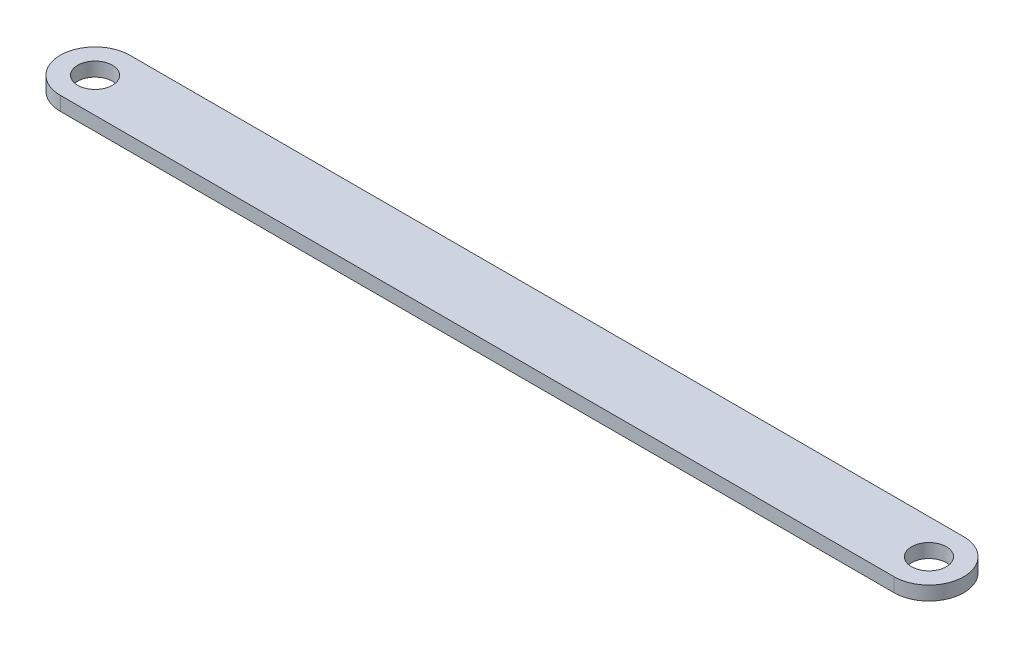
ISO-10303-21;
HEADER;
FILE_DESCRIPTION(('STEP AP214'),'2;1');
FILE_NAME('part.step','',(''),(''),'','','');
FILE_SCHEMA(('AUTOMOTIVE_DESIGN { 1 0 10303 214 1 1 1 1 }'));
ENDSEC;
DATA;
#1=APPLICATION_CONTEXT('core data for automotive mechanical design processes');
#2=APPLICATION_PROTOCOL_DEFINITION('international standard','automotive_design',2000,#1);
#3=PRODUCT_CONTEXT('',#1,'mechanical');
#4=PRODUCT('Part','Part','',(#3));
#5=PRODUCT_RELATED_PRODUCT_CATEGORY('part','',(#4));
#6=PRODUCT_DEFINITION_FORMATION('','',#4);
#7=PRODUCT_DEFINITION_CONTEXT('part definition',#1,'design');
#8=PRODUCT_DEFINITION('design','',#6,#7);
#9=PRODUCT_DEFINITION_SHAPE('','',#8);
#10=(LENGTH_UNIT() NAMED_UNIT(*) SI_UNIT(.MILLI.,.METRE.));
#11=(NAMED_UNIT(*) PLANE_ANGLE_UNIT() SI_UNIT($,.RADIAN.));
#12=(NAMED_UNIT(*) SI_UNIT($,.STERADIAN.) SOLID_ANGLE_UNIT());
#13=UNCERTAINTY_MEASURE_WITH_UNIT(LENGTH_MEASURE(1.E-05),#10,'distance_accuracy_value','');
#14=(GEOMETRIC_REPRESENTATION_CONTEXT(3) GLOBAL_UNCERTAINTY_ASSIGNED_CONTEXT((#13)) GLOBAL_UNIT_ASSIGNED_CONTEXT((#10,
#11,#12)) REPRESENTATION_CONTEXT('',''));
#15=CARTESIAN_POINT('',(0.,0.,0.));
#16=DIRECTION('',(0.,0.,1.));
#17=DIRECTION('',(1.,0.,0.));
#18=AXIS2_PLACEMENT_3D('',#15,#16,#17);
#19=CARTESIAN_POINT('',(-76.2,1.27,0.));
#20=DIRECTION('',(0.,1.,0.));
#21=DIRECTION('',(0.,0.,1.));
#22=AXIS2_PLACEMENT_3D('',#19,#20,#21);
#23=PLANE('',#22);
#24=CARTESIAN_POINT('',(76.2,1.27,0.));
#25=DIRECTION('',(0.,1.,0.));
#26=DIRECTION('',(0.,0.,1.));
#27=AXIS2_PLACEMENT_3D('',#24,#25,#26);
#28=CIRCLE('',#27,3.175);
#29=CARTESIAN_POINT('',(76.2,1.27,3.17499999999997));
#30=VERTEX_POINT('',#29);
#31=EDGE_CURVE('E118',#30,#30,#28,.T.);
#32=ORIENTED_EDGE('',*,*,#31,.F.);
#33=EDGE_LOOP('',(#32));
#34=FACE_BOUND('',#33,.T.);
#35=CARTESIAN_POINT('',(-76.2,1.27,0.));
#36=DIRECTION('',(0.,1.,0.));
#37=DIRECTION('',(0.,0.,1.));
#38=AXIS2_PLACEMENT_3D('',#35,#36,#37);
#39=CIRCLE('',#38,6.35);
#40=CARTESIAN_POINT('',(-76.2,1.27,-6.35));
#41=VERTEX_POINT('',#40);
#42=CARTESIAN_POINT('',(-76.2,1.27,6.35));
#43=VERTEX_POINT('',#42);
#44=EDGE_CURVE('E98',#41,#43,#39,.T.);
#45=ORIENTED_EDGE('',*,*,#44,.T.);
#46=DIRECTION('',(1.,0.,0.));
#47=VECTOR('',#46,1.);
#48=CARTESIAN_POINT('',(76.2,1.27,6.35));
#49=LINE('',#48,#47);
#50=CARTESIAN_POINT('',(76.2,1.27,6.34999999999997));
#51=VERTEX_POINT('',#50);
#52=EDGE_CURVE('E93',#43,#51,#49,.T.);
#53=ORIENTED_EDGE('',*,*,#52,.T.);
#54=CARTESIAN_POINT('',(76.2,1.27,0.));
#55=DIRECTION('',(0.,1.,0.));
#56=DIRECTION('',(0.,0.,-1.));
#57=AXIS2_PLACEMENT_3D('',#54,#55,#56);
#58=CIRCLE('',#57,6.35);
#59=CARTESIAN_POINT('',(76.2,1.27,-6.35));
#60=VERTEX_POINT('',#59);
#61=EDGE_CURVE('E96',#51,#60,#58,.T.);
#62=ORIENTED_EDGE('',*,*,#61,.T.);
#63=DIRECTION('',(-1.,0.,0.));
#64=VECTOR('',#63,1.);
#65=CARTESIAN_POINT('',(-76.2,1.27,-6.35));
#66=LINE('',#65,#64);
#67=EDGE_CURVE('E63',#60,#41,#66,.T.);
#68=ORIENTED_EDGE('',*,*,#67,.T.);
#69=EDGE_LOOP('',(#45,#53,#62,#68));
#70=FACE_BOUND('',#69,.T.);
#71=CARTESIAN_POINT('',(-76.2,1.27,0.));
#72=DIRECTION('',(0.,1.,0.));
#73=DIRECTION('',(0.,0.,-1.));
#74=AXIS2_PLACEMENT_3D('',#71,#72,#73);
#75=CIRCLE('',#74,3.17500000000001);
#76=CARTESIAN_POINT('',(-76.2,1.27,-3.17500000000001));
#77=VERTEX_POINT('',#76);
#78=EDGE_CURVE('E140',#77,#77,#75,.T.);
#79=ORIENTED_EDGE('',*,*,#78,.F.);
#80=EDGE_LOOP('',(#79));
#81=FACE_BOUND('',#80,.T.);
#82=ADVANCED_FACE('F45',(#34,#70,#81),#23,.T.);
#83=CARTESIAN_POINT('',(-76.2,-1.27,0.));
#84=DIRECTION('',(0.,1.,0.));
#85=DIRECTION('',(0.,0.,1.));
#86=AXIS2_PLACEMENT_3D('',#83,#84,#85);
#87=PLANE('',#86);
#88=CARTESIAN_POINT('',(-76.2,-1.27,0.));
#89=DIRECTION('',(0.,1.,0.));
#90=DIRECTION('',(0.,0.,1.));
#91=AXIS2_PLACEMENT_3D('',#88,#89,#90);
#92=CIRCLE('',#91,6.35);
#93=CARTESIAN_POINT('',(-76.2,-1.27,-6.35));
#94=VERTEX_POINT('',#93);
#95=CARTESIAN_POINT('',(-76.2,-1.27,6.35));
#96=VERTEX_POINT('',#95);
#97=EDGE_CURVE('E114',#94,#96,#92,.T.);
#98=ORIENTED_EDGE('',*,*,#97,.F.);
#99=DIRECTION('',(-1.,0.,0.));
#100=VECTOR('',#99,1.);
#101=CARTESIAN_POINT('',(-76.2,-1.27,-6.35));
#102=LINE('',#101,#100);
#103=CARTESIAN_POINT('',(76.2,-1.27,-6.35));
#104=VERTEX_POINT('',#103);
#105=EDGE_CURVE('E86',#104,#94,#102,.T.);
#106=ORIENTED_EDGE('',*,*,#105,.F.);
#107=CARTESIAN_POINT('',(76.2,-1.27,0.));
#108=DIRECTION('',(0.,1.,0.));
#109=DIRECTION('',(0.,0.,-1.));
#110=AXIS2_PLACEMENT_3D('',#107,#108,#109);
#111=CIRCLE('',#110,6.35);
#112=CARTESIAN_POINT('',(76.2,-1.27,6.34999999999997));
#113=VERTEX_POINT('',#112);
#114=EDGE_CURVE('E80',#113,#104,#111,.T.);
#115=ORIENTED_EDGE('',*,*,#114,.F.);
#116=DIRECTION('',(1.,0.,0.));
#117=VECTOR('',#116,1.);
#118=CARTESIAN_POINT('',(76.2,-1.27,6.35));
#119=LINE('',#118,#117);
#120=EDGE_CURVE('E103',#96,#113,#119,.T.);
#121=ORIENTED_EDGE('',*,*,#120,.F.);
#122=EDGE_LOOP('',(#98,#106,#115,#121));
#123=FACE_BOUND('',#122,.T.);
#124=CARTESIAN_POINT('',(76.2,-1.27,0.));
#125=DIRECTION('',(0.,1.,0.));
#126=DIRECTION('',(0.,0.,1.));
#127=AXIS2_PLACEMENT_3D('',#124,#125,#126);
#128=CIRCLE('',#127,3.175);
#129=CARTESIAN_POINT('',(76.2,-1.27,3.17499999999997));
#130=VERTEX_POINT('',#129);
#131=EDGE_CURVE('E136',#130,#130,#128,.T.);
#132=ORIENTED_EDGE('',*,*,#131,.T.);
#133=EDGE_LOOP('',(#132));
#134=FACE_BOUND('',#133,.T.);
#135=CARTESIAN_POINT('',(-76.2,-1.27,0.));
#136=DIRECTION('',(0.,1.,0.));
#137=DIRECTION('',(0.,0.,-1.));
#138=AXIS2_PLACEMENT_3D('',#135,#136,#137);
#139=CIRCLE('',#138,3.17500000000001);
#140=CARTESIAN_POINT('',(-76.2,-1.27,-3.17500000000001));
#141=VERTEX_POINT('',#140);
#142=EDGE_CURVE('E144',#141,#141,#139,.T.);
#143=ORIENTED_EDGE('',*,*,#142,.T.);
#144=EDGE_LOOP('',(#143));
#145=FACE_BOUND('',#144,.T.);
#146=ADVANCED_FACE('F131',(#123,#134,#145),#87,.F.);
#147=CARTESIAN_POINT('',(-76.2,1.27,0.));
#148=DIRECTION('',(0.,-1.,0.));
#149=DIRECTION('',(0.,0.,-1.));
#150=AXIS2_PLACEMENT_3D('',#147,#148,#149);
#151=CYLINDRICAL_SURFACE('',#150,6.35);
#152=ORIENTED_EDGE('',*,*,#97,.T.);
#153=DIRECTION('',(0.,-1.,0.));
#154=VECTOR('',#153,1.);
#155=CARTESIAN_POINT('',(-76.2,1.27,6.35));
#156=LINE('',#155,#154);
#157=EDGE_CURVE('E11',#43,#96,#156,.T.);
#158=ORIENTED_EDGE('',*,*,#157,.F.);
#159=ORIENTED_EDGE('',*,*,#44,.F.);
#160=DIRECTION('',(0.,-1.,0.));
#161=VECTOR('',#160,1.);
#162=CARTESIAN_POINT('',(-76.2,1.27,-6.35));
#163=LINE('',#162,#161);
#164=EDGE_CURVE('E110',#41,#94,#163,.T.);
#165=ORIENTED_EDGE('',*,*,#164,.T.);
#166=EDGE_LOOP('',(#152,#158,#159,#165));
#167=FACE_BOUND('',#166,.T.);
#168=ADVANCED_FACE('F47',(#167),#151,.T.);
#169=CARTESIAN_POINT('',(76.2,1.27,6.35));
#170=DIRECTION('',(0.,0.,-1.));
#171=DIRECTION('',(-1.,0.,0.));
#172=AXIS2_PLACEMENT_3D('',#169,#170,#171);
#173=PLANE('',#172);
#174=ORIENTED_EDGE('',*,*,#120,.T.);
#175=DIRECTION('',(0.,-1.,0.));
#176=VECTOR('',#175,1.);
#177=CARTESIAN_POINT('',(76.2,1.27,6.34999999999997));
#178=LINE('',#177,#176);
#179=EDGE_CURVE('E55',#51,#113,#178,.T.);
#180=ORIENTED_EDGE('',*,*,#179,.F.);
#181=ORIENTED_EDGE('',*,*,#52,.F.);
#182=ORIENTED_EDGE('',*,*,#157,.T.);
#183=EDGE_LOOP('',(#174,#180,#181,#182));
#184=FACE_BOUND('',#183,.T.);
#185=ADVANCED_FACE('F102',(#184),#173,.F.);
#186=CARTESIAN_POINT('',(76.2,1.27,0.));
#187=DIRECTION('',(0.,-1.,0.));
#188=DIRECTION('',(0.,0.,-1.));
#189=AXIS2_PLACEMENT_3D('',#186,#187,#188);
#190=CYLINDRICAL_SURFACE('',#189,6.35);
#191=ORIENTED_EDGE('',*,*,#114,.T.);
#192=DIRECTION('',(0.,-1.,0.));
#193=VECTOR('',#192,1.);
#194=CARTESIAN_POINT('',(76.2,1.27,-6.35));
#195=LINE('',#194,#193);
#196=EDGE_CURVE('E105',#60,#104,#195,.T.);
#197=ORIENTED_EDGE('',*,*,#196,.F.);
#198=ORIENTED_EDGE('',*,*,#61,.F.);
#199=ORIENTED_EDGE('',*,*,#179,.T.);
#200=EDGE_LOOP('',(#191,#197,#198,#199));
#201=FACE_BOUND('',#200,.T.);
#202=ADVANCED_FACE('F106',(#201),#190,.T.);
#203=CARTESIAN_POINT('',(-76.2,1.27,-6.35));
#204=DIRECTION('',(0.,0.,1.));
#205=DIRECTION('',(1.,0.,0.));
#206=AXIS2_PLACEMENT_3D('',#203,#204,#205);
#207=PLANE('',#206);
#208=ORIENTED_EDGE('',*,*,#105,.T.);
#209=ORIENTED_EDGE('',*,*,#164,.F.);
#210=ORIENTED_EDGE('',*,*,#67,.F.);
#211=ORIENTED_EDGE('',*,*,#196,.T.);
#212=EDGE_LOOP('',(#208,#209,#210,#211));
#213=FACE_BOUND('',#212,.T.);
#214=ADVANCED_FACE('F128',(#213),#207,.F.);
#215=CARTESIAN_POINT('',(76.2,1.27,0.));
#216=DIRECTION('',(0.,-1.,0.));
#217=DIRECTION('',(0.,0.,-1.));
#218=AXIS2_PLACEMENT_3D('',#215,#216,#217);
#219=CYLINDRICAL_SURFACE('',#218,3.175);
#220=ORIENTED_EDGE('',*,*,#31,.T.);
#221=EDGE_LOOP('',(#220));
#222=FACE_BOUND('',#221,.T.);
#223=ORIENTED_EDGE('',*,*,#131,.F.);
#224=EDGE_LOOP('',(#223));
#225=FACE_BOUND('',#224,.T.);
#226=ADVANCED_FACE('F163',(#222,#225),#219,.F.);
#227=CARTESIAN_POINT('',(-76.2,1.27,0.));
#228=DIRECTION('',(0.,-1.,0.));
#229=DIRECTION('',(0.,0.,-1.));
#230=AXIS2_PLACEMENT_3D('',#227,#228,#229);
#231=CYLINDRICAL_SURFACE('',#230,3.17500000000001);
#232=ORIENTED_EDGE('',*,*,#78,.T.);
#233=EDGE_LOOP('',(#232));
#234=FACE_BOUND('',#233,.T.);
#235=ORIENTED_EDGE('',*,*,#142,.F.);
#236=EDGE_LOOP('',(#235));
#237=FACE_BOUND('',#236,.T.);
#238=ADVANCED_FACE('F152',(#234,#237),#231,.F.);
#239=CLOSED_SHELL('',(#82,#146,#168,#185,#202,#214,#226,#238));
#240=MANIFOLD_SOLID_BREP('B2',#239);
#241=ADVANCED_BREP_SHAPE_REPRESENTATION('',(#18,#240),#14);
#242=SHAPE_DEFINITION_REPRESENTATION(#9,#241);
ENDSEC;
END-ISO-10303-21;
